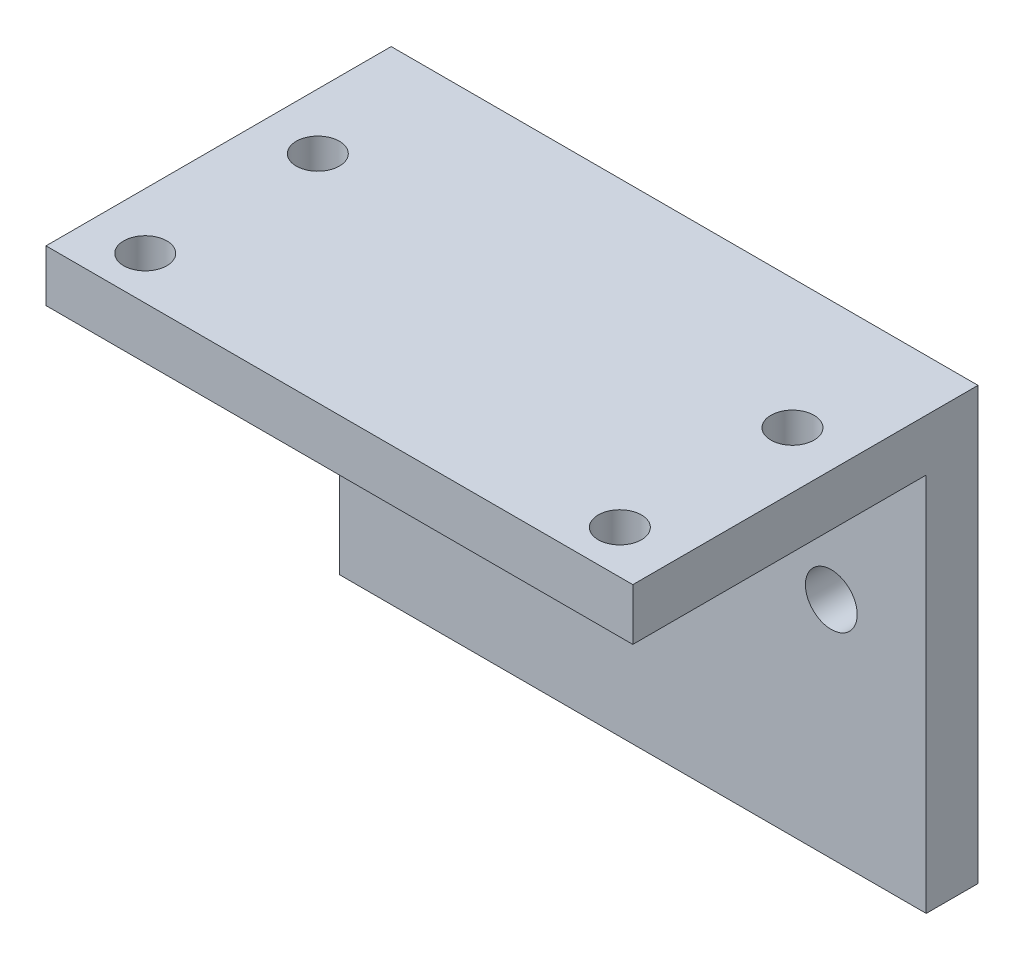
ISO-10303-21;
HEADER;
FILE_DESCRIPTION(('STEP AP214'),'2;1');
FILE_NAME('part.step','',(''),(''),'','','');
FILE_SCHEMA(('AUTOMOTIVE_DESIGN { 1 0 10303 214 1 1 1 1 }'));
ENDSEC;
DATA;
#1=APPLICATION_CONTEXT('core data for automotive mechanical design processes');
#2=APPLICATION_PROTOCOL_DEFINITION('international standard','automotive_design',2000,#1);
#3=PRODUCT_CONTEXT('',#1,'mechanical');
#4=PRODUCT('Part','Part','',(#3));
#5=PRODUCT_RELATED_PRODUCT_CATEGORY('part','',(#4));
#6=PRODUCT_DEFINITION_FORMATION('','',#4);
#7=PRODUCT_DEFINITION_CONTEXT('part definition',#1,'design');
#8=PRODUCT_DEFINITION('design','',#6,#7);
#9=PRODUCT_DEFINITION_SHAPE('','',#8);
#10=(LENGTH_UNIT() NAMED_UNIT(*) SI_UNIT(.MILLI.,.METRE.));
#11=(NAMED_UNIT(*) PLANE_ANGLE_UNIT() SI_UNIT($,.RADIAN.));
#12=(NAMED_UNIT(*) SI_UNIT($,.STERADIAN.) SOLID_ANGLE_UNIT());
#13=UNCERTAINTY_MEASURE_WITH_UNIT(LENGTH_MEASURE(1.E-05),#10,'distance_accuracy_value','');
#14=(GEOMETRIC_REPRESENTATION_CONTEXT(3) GLOBAL_UNCERTAINTY_ASSIGNED_CONTEXT((#13)) GLOBAL_UNIT_ASSIGNED_CONTEXT((#10,
#11,#12)) REPRESENTATION_CONTEXT('',''));
#15=CARTESIAN_POINT('',(0.,0.,0.));
#16=DIRECTION('',(0.,0.,1.));
#17=DIRECTION('',(1.,0.,0.));
#18=AXIS2_PLACEMENT_3D('',#15,#16,#17);
#19=CARTESIAN_POINT('',(0.,6.,0.));
#20=DIRECTION('',(0.,1.,0.));
#21=DIRECTION('',(0.,0.,1.));
#22=AXIS2_PLACEMENT_3D('',#19,#20,#21);
#23=PLANE('',#22);
#24=DIRECTION('',(0.,0.,-1.));
#25=VECTOR('',#24,1.);
#26=CARTESIAN_POINT('',(34.,6.,-40.));
#27=LINE('',#26,#25);
#28=CARTESIAN_POINT('',(34.,6.,0.));
#29=VERTEX_POINT('',#28);
#30=CARTESIAN_POINT('',(34.,6.,-40.));
#31=VERTEX_POINT('',#30);
#32=EDGE_CURVE('E156',#29,#31,#27,.T.);
#33=ORIENTED_EDGE('',*,*,#32,.T.);
#34=DIRECTION('',(-1.,0.,0.));
#35=VECTOR('',#34,1.);
#36=CARTESIAN_POINT('',(-34.,6.,-40.));
#37=LINE('',#36,#35);
#38=CARTESIAN_POINT('',(-34.,6.,-40.));
#39=VERTEX_POINT('',#38);
#40=EDGE_CURVE('E59',#31,#39,#37,.T.);
#41=ORIENTED_EDGE('',*,*,#40,.T.);
#42=DIRECTION('',(0.,0.,1.));
#43=VECTOR('',#42,1.);
#44=CARTESIAN_POINT('',(-34.,6.,-40.));
#45=LINE('',#44,#43);
#46=CARTESIAN_POINT('',(-34.,6.,0.));
#47=VERTEX_POINT('',#46);
#48=EDGE_CURVE('E79',#39,#47,#45,.T.);
#49=ORIENTED_EDGE('',*,*,#48,.T.);
#50=DIRECTION('',(1.,0.,0.));
#51=VECTOR('',#50,1.);
#52=CARTESIAN_POINT('',(-34.,6.,0.));
#53=LINE('',#52,#51);
#54=EDGE_CURVE('E153',#47,#29,#53,.T.);
#55=ORIENTED_EDGE('',*,*,#54,.T.);
#56=EDGE_LOOP('',(#33,#41,#49,#55));
#57=FACE_BOUND('',#56,.T.);
#58=CARTESIAN_POINT('',(-27.5,6.,-5.));
#59=DIRECTION('',(0.,1.,0.));
#60=DIRECTION('',(0.,0.,1.));
#61=AXIS2_PLACEMENT_3D('',#58,#59,#60);
#62=CIRCLE('',#61,2.5);
#63=CARTESIAN_POINT('',(-27.5,6.,-2.5));
#64=VERTEX_POINT('',#63);
#65=EDGE_CURVE('E134',#64,#64,#62,.T.);
#66=ORIENTED_EDGE('',*,*,#65,.F.);
#67=EDGE_LOOP('',(#66));
#68=FACE_BOUND('',#67,.T.);
#69=CARTESIAN_POINT('',(-27.5,6.,-25.));
#70=DIRECTION('',(0.,1.,0.));
#71=DIRECTION('',(0.,0.,1.));
#72=AXIS2_PLACEMENT_3D('',#69,#70,#71);
#73=CIRCLE('',#72,2.5);
#74=CARTESIAN_POINT('',(-27.5,6.,-22.5));
#75=VERTEX_POINT('',#74);
#76=EDGE_CURVE('E146',#75,#75,#73,.T.);
#77=ORIENTED_EDGE('',*,*,#76,.F.);
#78=EDGE_LOOP('',(#77));
#79=FACE_BOUND('',#78,.T.);
#80=CARTESIAN_POINT('',(27.5,6.,-25.));
#81=DIRECTION('',(0.,1.,0.));
#82=DIRECTION('',(0.,0.,1.));
#83=AXIS2_PLACEMENT_3D('',#80,#81,#82);
#84=CIRCLE('',#83,2.49999999999999);
#85=CARTESIAN_POINT('',(27.5,6.,-22.5));
#86=VERTEX_POINT('',#85);
#87=EDGE_CURVE('E140',#86,#86,#84,.T.);
#88=ORIENTED_EDGE('',*,*,#87,.F.);
#89=EDGE_LOOP('',(#88));
#90=FACE_BOUND('',#89,.T.);
#91=CARTESIAN_POINT('',(27.5,6.,-5.));
#92=DIRECTION('',(0.,1.,0.));
#93=DIRECTION('',(0.,0.,1.));
#94=AXIS2_PLACEMENT_3D('',#91,#92,#93);
#95=CIRCLE('',#94,2.49999999999999);
#96=CARTESIAN_POINT('',(27.5,6.,-2.50000000000001));
#97=VERTEX_POINT('',#96);
#98=EDGE_CURVE('E128',#97,#97,#95,.T.);
#99=ORIENTED_EDGE('',*,*,#98,.F.);
#100=EDGE_LOOP('',(#99));
#101=FACE_BOUND('',#100,.T.);
#102=ADVANCED_FACE('F35',(#57,#68,#79,#90,#101),#23,.T.);
#103=CARTESIAN_POINT('',(0.,0.,0.));
#104=DIRECTION('',(0.,1.,0.));
#105=DIRECTION('',(0.,0.,1.));
#106=AXIS2_PLACEMENT_3D('',#103,#104,#105);
#107=PLANE('',#106);
#108=CARTESIAN_POINT('',(-27.5,0.,-5.));
#109=DIRECTION('',(0.,1.,0.));
#110=DIRECTION('',(0.,0.,1.));
#111=AXIS2_PLACEMENT_3D('',#108,#109,#110);
#112=CIRCLE('',#111,2.5);
#113=CARTESIAN_POINT('',(-27.5,0.,-2.5));
#114=VERTEX_POINT('',#113);
#115=EDGE_CURVE('E131',#114,#114,#112,.T.);
#116=ORIENTED_EDGE('',*,*,#115,.T.);
#117=EDGE_LOOP('',(#116));
#118=FACE_BOUND('',#117,.T.);
#119=CARTESIAN_POINT('',(-27.5,0.,-25.));
#120=DIRECTION('',(0.,1.,0.));
#121=DIRECTION('',(0.,0.,1.));
#122=AXIS2_PLACEMENT_3D('',#119,#120,#121);
#123=CIRCLE('',#122,2.5);
#124=CARTESIAN_POINT('',(-27.5,0.,-22.5));
#125=VERTEX_POINT('',#124);
#126=EDGE_CURVE('E143',#125,#125,#123,.T.);
#127=ORIENTED_EDGE('',*,*,#126,.T.);
#128=EDGE_LOOP('',(#127));
#129=FACE_BOUND('',#128,.T.);
#130=DIRECTION('',(0.,0.,1.));
#131=VECTOR('',#130,1.);
#132=CARTESIAN_POINT('',(-34.,0.,-40.));
#133=LINE('',#132,#131);
#134=CARTESIAN_POINT('',(-34.,0.,-34.));
#135=VERTEX_POINT('',#134);
#136=CARTESIAN_POINT('',(-34.,0.,0.));
#137=VERTEX_POINT('',#136);
#138=EDGE_CURVE('E149',#135,#137,#133,.T.);
#139=ORIENTED_EDGE('',*,*,#138,.F.);
#140=DIRECTION('',(1.,0.,0.));
#141=VECTOR('',#140,1.);
#142=CARTESIAN_POINT('',(0.,0.,-34.));
#143=LINE('',#142,#141);
#144=CARTESIAN_POINT('',(34.,0.,-34.));
#145=VERTEX_POINT('',#144);
#146=EDGE_CURVE('E98',#135,#145,#143,.T.);
#147=ORIENTED_EDGE('',*,*,#146,.T.);
#148=DIRECTION('',(0.,0.,-1.));
#149=VECTOR('',#148,1.);
#150=CARTESIAN_POINT('',(34.,0.,-40.));
#151=LINE('',#150,#149);
#152=CARTESIAN_POINT('',(34.,0.,0.));
#153=VERTEX_POINT('',#152);
#154=EDGE_CURVE('E154',#153,#145,#151,.T.);
#155=ORIENTED_EDGE('',*,*,#154,.F.);
#156=DIRECTION('',(1.,0.,0.));
#157=VECTOR('',#156,1.);
#158=CARTESIAN_POINT('',(-34.,0.,0.));
#159=LINE('',#158,#157);
#160=EDGE_CURVE('E74',#137,#153,#159,.T.);
#161=ORIENTED_EDGE('',*,*,#160,.F.);
#162=EDGE_LOOP('',(#139,#147,#155,#161));
#163=FACE_BOUND('',#162,.T.);
#164=CARTESIAN_POINT('',(27.5,0.,-25.));
#165=DIRECTION('',(0.,1.,0.));
#166=DIRECTION('',(0.,0.,1.));
#167=AXIS2_PLACEMENT_3D('',#164,#165,#166);
#168=CIRCLE('',#167,2.49999999999999);
#169=CARTESIAN_POINT('',(27.5,0.,-22.5));
#170=VERTEX_POINT('',#169);
#171=EDGE_CURVE('E137',#170,#170,#168,.T.);
#172=ORIENTED_EDGE('',*,*,#171,.T.);
#173=EDGE_LOOP('',(#172));
#174=FACE_BOUND('',#173,.T.);
#175=CARTESIAN_POINT('',(27.5,0.,-5.));
#176=DIRECTION('',(0.,1.,0.));
#177=DIRECTION('',(0.,0.,1.));
#178=AXIS2_PLACEMENT_3D('',#175,#176,#177);
#179=CIRCLE('',#178,2.49999999999999);
#180=CARTESIAN_POINT('',(27.5,0.,-2.50000000000001));
#181=VERTEX_POINT('',#180);
#182=EDGE_CURVE('E127',#181,#181,#179,.T.);
#183=ORIENTED_EDGE('',*,*,#182,.T.);
#184=EDGE_LOOP('',(#183));
#185=FACE_BOUND('',#184,.T.);
#186=ADVANCED_FACE('F171',(#118,#129,#163,#174,#185),#107,.F.);
#187=CARTESIAN_POINT('',(-34.,6.,-40.));
#188=DIRECTION('',(1.,0.,0.));
#189=DIRECTION('',(0.,0.,-1.));
#190=AXIS2_PLACEMENT_3D('',#187,#188,#189);
#191=PLANE('',#190);
#192=DIRECTION('',(0.,-1.,0.));
#193=VECTOR('',#192,1.);
#194=CARTESIAN_POINT('',(-34.,6.,0.));
#195=LINE('',#194,#193);
#196=EDGE_CURVE('E11',#47,#137,#195,.T.);
#197=ORIENTED_EDGE('',*,*,#196,.F.);
#198=ORIENTED_EDGE('',*,*,#48,.F.);
#199=DIRECTION('',(0.,-1.,0.));
#200=VECTOR('',#199,1.);
#201=CARTESIAN_POINT('',(-34.,6.,-40.));
#202=LINE('',#201,#200);
#203=CARTESIAN_POINT('',(-34.,-44.,-40.));
#204=VERTEX_POINT('',#203);
#205=EDGE_CURVE('E115',#39,#204,#202,.T.);
#206=ORIENTED_EDGE('',*,*,#205,.T.);
#207=DIRECTION('',(0.,0.,1.));
#208=VECTOR('',#207,1.);
#209=CARTESIAN_POINT('',(-34.,-44.,-40.));
#210=LINE('',#209,#208);
#211=CARTESIAN_POINT('',(-34.,-44.,-34.));
#212=VERTEX_POINT('',#211);
#213=EDGE_CURVE('E109',#204,#212,#210,.T.);
#214=ORIENTED_EDGE('',*,*,#213,.T.);
#215=DIRECTION('',(0.,1.,0.));
#216=VECTOR('',#215,1.);
#217=CARTESIAN_POINT('',(-34.,-44.,-34.));
#218=LINE('',#217,#216);
#219=EDGE_CURVE('E94',#212,#135,#218,.T.);
#220=ORIENTED_EDGE('',*,*,#219,.T.);
#221=ORIENTED_EDGE('',*,*,#138,.T.);
#222=EDGE_LOOP('',(#197,#198,#206,#214,#220,#221));
#223=FACE_BOUND('',#222,.T.);
#224=ADVANCED_FACE('F37',(#223),#191,.F.);
#225=CARTESIAN_POINT('',(-34.,6.,0.));
#226=DIRECTION('',(0.,0.,-1.));
#227=DIRECTION('',(-1.,0.,0.));
#228=AXIS2_PLACEMENT_3D('',#225,#226,#227);
#229=PLANE('',#228);
#230=ORIENTED_EDGE('',*,*,#160,.T.);
#231=DIRECTION('',(0.,-1.,0.));
#232=VECTOR('',#231,1.);
#233=CARTESIAN_POINT('',(34.,6.,0.));
#234=LINE('',#233,#232);
#235=EDGE_CURVE('E43',#29,#153,#234,.T.);
#236=ORIENTED_EDGE('',*,*,#235,.F.);
#237=ORIENTED_EDGE('',*,*,#54,.F.);
#238=ORIENTED_EDGE('',*,*,#196,.T.);
#239=EDGE_LOOP('',(#230,#236,#237,#238));
#240=FACE_BOUND('',#239,.T.);
#241=ADVANCED_FACE('F173',(#240),#229,.F.);
#242=CARTESIAN_POINT('',(34.,6.,-40.));
#243=DIRECTION('',(-1.,0.,0.));
#244=DIRECTION('',(0.,0.,1.));
#245=AXIS2_PLACEMENT_3D('',#242,#243,#244);
#246=PLANE('',#245);
#247=ORIENTED_EDGE('',*,*,#154,.T.);
#248=DIRECTION('',(0.,1.,0.));
#249=VECTOR('',#248,1.);
#250=CARTESIAN_POINT('',(34.,-44.,-34.));
#251=LINE('',#250,#249);
#252=CARTESIAN_POINT('',(34.,-44.,-34.));
#253=VERTEX_POINT('',#252);
#254=EDGE_CURVE('E50',#253,#145,#251,.T.);
#255=ORIENTED_EDGE('',*,*,#254,.F.);
#256=DIRECTION('',(0.,0.,-1.));
#257=VECTOR('',#256,1.);
#258=CARTESIAN_POINT('',(34.,-44.,-40.));
#259=LINE('',#258,#257);
#260=CARTESIAN_POINT('',(34.,-44.,-40.));
#261=VERTEX_POINT('',#260);
#262=EDGE_CURVE('E112',#253,#261,#259,.T.);
#263=ORIENTED_EDGE('',*,*,#262,.T.);
#264=DIRECTION('',(0.,-1.,0.));
#265=VECTOR('',#264,1.);
#266=CARTESIAN_POINT('',(34.,6.,-40.));
#267=LINE('',#266,#265);
#268=EDGE_CURVE('E164',#31,#261,#267,.T.);
#269=ORIENTED_EDGE('',*,*,#268,.F.);
#270=ORIENTED_EDGE('',*,*,#32,.F.);
#271=ORIENTED_EDGE('',*,*,#235,.T.);
#272=EDGE_LOOP('',(#247,#255,#263,#269,#270,#271));
#273=FACE_BOUND('',#272,.T.);
#274=ADVANCED_FACE('F168',(#273),#246,.F.);
#275=CARTESIAN_POINT('',(-34.,6.,-40.));
#276=DIRECTION('',(0.,0.,1.));
#277=DIRECTION('',(1.,0.,0.));
#278=AXIS2_PLACEMENT_3D('',#275,#276,#277);
#279=PLANE('',#278);
#280=CARTESIAN_POINT('',(-25.,-18.,-40.));
#281=DIRECTION('',(0.,0.,1.));
#282=DIRECTION('',(1.,0.,0.));
#283=AXIS2_PLACEMENT_3D('',#280,#281,#282);
#284=CIRCLE('',#283,3.);
#285=CARTESIAN_POINT('',(-22.,-18.,-40.));
#286=VERTEX_POINT('',#285);
#287=EDGE_CURVE('E233',#286,#286,#284,.F.);
#288=ORIENTED_EDGE('',*,*,#287,.F.);
#289=EDGE_LOOP('',(#288));
#290=FACE_BOUND('',#289,.T.);
#291=CARTESIAN_POINT('',(23.,-18.,-40.));
#292=DIRECTION('',(0.,0.,1.));
#293=DIRECTION('',(1.,0.,0.));
#294=AXIS2_PLACEMENT_3D('',#291,#292,#293);
#295=CIRCLE('',#294,3.);
#296=CARTESIAN_POINT('',(26.,-18.,-40.));
#297=VERTEX_POINT('',#296);
#298=EDGE_CURVE('E237',#297,#297,#295,.F.);
#299=ORIENTED_EDGE('',*,*,#298,.F.);
#300=EDGE_LOOP('',(#299));
#301=FACE_BOUND('',#300,.T.);
#302=CARTESIAN_POINT('',(-1.00000000000001,-18.,-40.));
#303=DIRECTION('',(0.,0.,1.));
#304=DIRECTION('',(1.,0.,0.));
#305=AXIS2_PLACEMENT_3D('',#302,#303,#304);
#306=CIRCLE('',#305,8.);
#307=CARTESIAN_POINT('',(6.99999999999999,-18.,-40.));
#308=VERTEX_POINT('',#307);
#309=EDGE_CURVE('E116',#308,#308,#306,.F.);
#310=ORIENTED_EDGE('',*,*,#309,.F.);
#311=EDGE_LOOP('',(#310));
#312=FACE_BOUND('',#311,.T.);
#313=ORIENTED_EDGE('',*,*,#268,.T.);
#314=DIRECTION('',(-1.,0.,0.));
#315=VECTOR('',#314,1.);
#316=CARTESIAN_POINT('',(-34.,-44.,-40.));
#317=LINE('',#316,#315);
#318=EDGE_CURVE('E102',#261,#204,#317,.T.);
#319=ORIENTED_EDGE('',*,*,#318,.T.);
#320=ORIENTED_EDGE('',*,*,#205,.F.);
#321=ORIENTED_EDGE('',*,*,#40,.F.);
#322=EDGE_LOOP('',(#313,#319,#320,#321));
#323=FACE_BOUND('',#322,.T.);
#324=ADVANCED_FACE('F176',(#290,#301,#312,#323),#279,.F.);
#325=CARTESIAN_POINT('',(-27.5,6.,-25.));
#326=DIRECTION('',(0.,-1.,0.));
#327=DIRECTION('',(0.,0.,-1.));
#328=AXIS2_PLACEMENT_3D('',#325,#326,#327);
#329=CYLINDRICAL_SURFACE('',#328,2.5);
#330=ORIENTED_EDGE('',*,*,#76,.T.);
#331=EDGE_LOOP('',(#330));
#332=FACE_BOUND('',#331,.T.);
#333=ORIENTED_EDGE('',*,*,#126,.F.);
#334=EDGE_LOOP('',(#333));
#335=FACE_BOUND('',#334,.T.);
#336=ADVANCED_FACE('F178',(#332,#335),#329,.F.);
#337=CARTESIAN_POINT('',(27.5,6.,-25.));
#338=DIRECTION('',(0.,-1.,0.));
#339=DIRECTION('',(0.,0.,-1.));
#340=AXIS2_PLACEMENT_3D('',#337,#338,#339);
#341=CYLINDRICAL_SURFACE('',#340,2.49999999999999);
#342=ORIENTED_EDGE('',*,*,#87,.T.);
#343=EDGE_LOOP('',(#342));
#344=FACE_BOUND('',#343,.T.);
#345=ORIENTED_EDGE('',*,*,#171,.F.);
#346=EDGE_LOOP('',(#345));
#347=FACE_BOUND('',#346,.T.);
#348=ADVANCED_FACE('F185',(#344,#347),#341,.F.);
#349=CARTESIAN_POINT('',(-27.5,6.,-5.));
#350=DIRECTION('',(0.,-1.,0.));
#351=DIRECTION('',(0.,0.,-1.));
#352=AXIS2_PLACEMENT_3D('',#349,#350,#351);
#353=CYLINDRICAL_SURFACE('',#352,2.5);
#354=ORIENTED_EDGE('',*,*,#65,.T.);
#355=EDGE_LOOP('',(#354));
#356=FACE_BOUND('',#355,.T.);
#357=ORIENTED_EDGE('',*,*,#115,.F.);
#358=EDGE_LOOP('',(#357));
#359=FACE_BOUND('',#358,.T.);
#360=ADVANCED_FACE('F201',(#356,#359),#353,.F.);
#361=CARTESIAN_POINT('',(27.5,6.,-5.));
#362=DIRECTION('',(0.,-1.,0.));
#363=DIRECTION('',(0.,0.,-1.));
#364=AXIS2_PLACEMENT_3D('',#361,#362,#363);
#365=CYLINDRICAL_SURFACE('',#364,2.49999999999999);
#366=ORIENTED_EDGE('',*,*,#98,.T.);
#367=EDGE_LOOP('',(#366));
#368=FACE_BOUND('',#367,.T.);
#369=ORIENTED_EDGE('',*,*,#182,.F.);
#370=EDGE_LOOP('',(#369));
#371=FACE_BOUND('',#370,.T.);
#372=ADVANCED_FACE('F205',(#368,#371),#365,.F.);
#373=CARTESIAN_POINT('',(-34.,-44.,-34.));
#374=DIRECTION('',(0.,0.,1.));
#375=DIRECTION('',(1.,0.,0.));
#376=AXIS2_PLACEMENT_3D('',#373,#374,#375);
#377=PLANE('',#376);
#378=CARTESIAN_POINT('',(-25.,-18.,-34.));
#379=DIRECTION('',(0.,0.,1.));
#380=DIRECTION('',(-1.,0.,0.));
#381=AXIS2_PLACEMENT_3D('',#378,#379,#380);
#382=CIRCLE('',#381,3.);
#383=CARTESIAN_POINT('',(-28.,-18.,-34.));
#384=VERTEX_POINT('',#383);
#385=EDGE_CURVE('E231',#384,#384,#382,.T.);
#386=ORIENTED_EDGE('',*,*,#385,.F.);
#387=EDGE_LOOP('',(#386));
#388=FACE_BOUND('',#387,.T.);
#389=CARTESIAN_POINT('',(23.,-18.,-34.));
#390=DIRECTION('',(0.,0.,1.));
#391=DIRECTION('',(1.,0.,0.));
#392=AXIS2_PLACEMENT_3D('',#389,#390,#391);
#393=CIRCLE('',#392,3.);
#394=CARTESIAN_POINT('',(26.,-18.,-34.));
#395=VERTEX_POINT('',#394);
#396=EDGE_CURVE('E234',#395,#395,#393,.T.);
#397=ORIENTED_EDGE('',*,*,#396,.F.);
#398=EDGE_LOOP('',(#397));
#399=FACE_BOUND('',#398,.T.);
#400=CARTESIAN_POINT('',(-1.00000000000001,-18.,-34.));
#401=DIRECTION('',(0.,0.,1.));
#402=DIRECTION('',(1.,0.,0.));
#403=AXIS2_PLACEMENT_3D('',#400,#401,#402);
#404=CIRCLE('',#403,8.);
#405=CARTESIAN_POINT('',(6.99999999999999,-18.,-34.));
#406=VERTEX_POINT('',#405);
#407=EDGE_CURVE('E119',#406,#406,#404,.T.);
#408=ORIENTED_EDGE('',*,*,#407,.F.);
#409=EDGE_LOOP('',(#408));
#410=FACE_BOUND('',#409,.T.);
#411=ORIENTED_EDGE('',*,*,#146,.F.);
#412=ORIENTED_EDGE('',*,*,#219,.F.);
#413=DIRECTION('',(1.,0.,0.));
#414=VECTOR('',#413,1.);
#415=CARTESIAN_POINT('',(-34.,-44.,-34.));
#416=LINE('',#415,#414);
#417=EDGE_CURVE('E97',#212,#253,#416,.T.);
#418=ORIENTED_EDGE('',*,*,#417,.T.);
#419=ORIENTED_EDGE('',*,*,#254,.T.);
#420=EDGE_LOOP('',(#411,#412,#418,#419));
#421=FACE_BOUND('',#420,.T.);
#422=ADVANCED_FACE('F96',(#388,#399,#410,#421),#377,.T.);
#423=CARTESIAN_POINT('',(0.,-44.,0.));
#424=DIRECTION('',(0.,1.,0.));
#425=DIRECTION('',(0.,0.,1.));
#426=AXIS2_PLACEMENT_3D('',#423,#424,#425);
#427=PLANE('',#426);
#428=ORIENTED_EDGE('',*,*,#213,.F.);
#429=ORIENTED_EDGE('',*,*,#318,.F.);
#430=ORIENTED_EDGE('',*,*,#262,.F.);
#431=ORIENTED_EDGE('',*,*,#417,.F.);
#432=EDGE_LOOP('',(#428,#429,#430,#431));
#433=FACE_BOUND('',#432,.T.);
#434=ADVANCED_FACE('F107',(#433),#427,.F.);
#435=CARTESIAN_POINT('',(-1.00000000000001,-18.,-40.001));
#436=DIRECTION('',(0.,0.,1.));
#437=DIRECTION('',(1.,0.,0.));
#438=AXIS2_PLACEMENT_3D('',#435,#436,#437);
#439=CYLINDRICAL_SURFACE('',#438,8.);
#440=ORIENTED_EDGE('',*,*,#407,.T.);
#441=EDGE_LOOP('',(#440));
#442=FACE_BOUND('',#441,.T.);
#443=ORIENTED_EDGE('',*,*,#309,.T.);
#444=EDGE_LOOP('',(#443));
#445=FACE_BOUND('',#444,.T.);
#446=ADVANCED_FACE('F215',(#442,#445),#439,.F.);
#447=CARTESIAN_POINT('',(23.,-18.,-40.001));
#448=DIRECTION('',(0.,0.,1.));
#449=DIRECTION('',(1.,0.,0.));
#450=AXIS2_PLACEMENT_3D('',#447,#448,#449);
#451=CYLINDRICAL_SURFACE('',#450,3.);
#452=ORIENTED_EDGE('',*,*,#396,.T.);
#453=EDGE_LOOP('',(#452));
#454=FACE_BOUND('',#453,.T.);
#455=ORIENTED_EDGE('',*,*,#298,.T.);
#456=EDGE_LOOP('',(#455));
#457=FACE_BOUND('',#456,.T.);
#458=ADVANCED_FACE('F218',(#454,#457),#451,.F.);
#459=CARTESIAN_POINT('',(-25.,-18.,-40.001));
#460=DIRECTION('',(0.,0.,1.));
#461=DIRECTION('',(1.,0.,0.));
#462=AXIS2_PLACEMENT_3D('',#459,#460,#461);
#463=CYLINDRICAL_SURFACE('',#462,3.);
#464=ORIENTED_EDGE('',*,*,#385,.T.);
#465=EDGE_LOOP('',(#464));
#466=FACE_BOUND('',#465,.T.);
#467=ORIENTED_EDGE('',*,*,#287,.T.);
#468=EDGE_LOOP('',(#467));
#469=FACE_BOUND('',#468,.T.);
#470=ADVANCED_FACE('F222',(#466,#469),#463,.F.);
#471=CLOSED_SHELL('',(#102,#186,#224,#241,#274,#324,#336,#348,#360,#372,#422,#434,#446,#458,#470));
#472=MANIFOLD_SOLID_BREP('B2',#471);
#473=ADVANCED_BREP_SHAPE_REPRESENTATION('',(#18,#472),#14);
#474=SHAPE_DEFINITION_REPRESENTATION(#9,#473);
ENDSEC;
END-ISO-10303-21;
